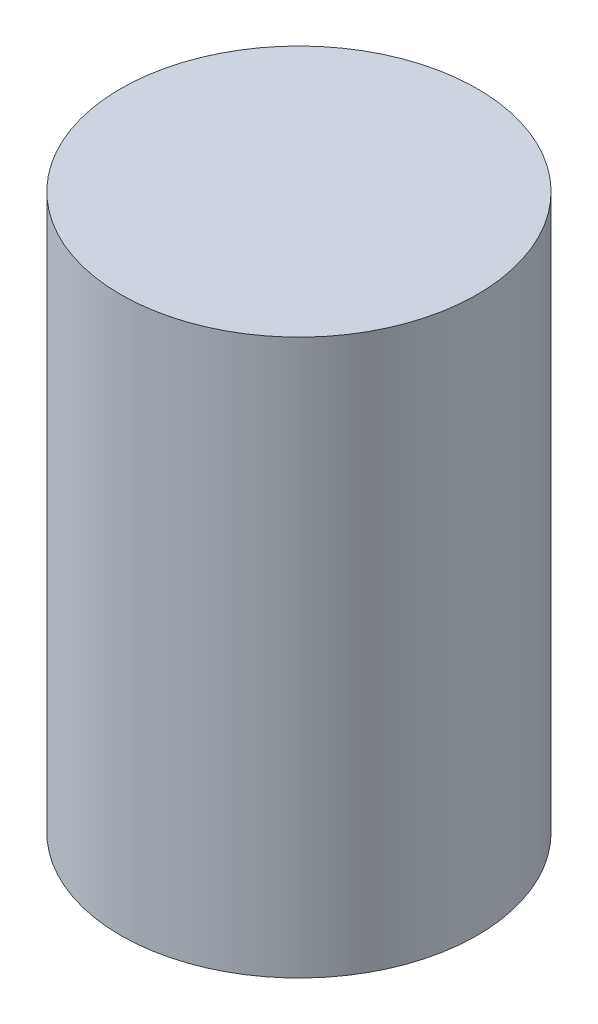
ISO-10303-21;
HEADER;
FILE_DESCRIPTION(('STEP AP214'),'2;1');
FILE_NAME('part.step','',(''),(''),'','','');
FILE_SCHEMA(('AUTOMOTIVE_DESIGN { 1 0 10303 214 1 1 1 1 }'));
ENDSEC;
DATA;
#1=APPLICATION_CONTEXT('core data for automotive mechanical design processes');
#2=APPLICATION_PROTOCOL_DEFINITION('international standard','automotive_design',2000,#1);
#3=PRODUCT_CONTEXT('',#1,'mechanical');
#4=PRODUCT('Part','Part','',(#3));
#5=PRODUCT_RELATED_PRODUCT_CATEGORY('part','',(#4));
#6=PRODUCT_DEFINITION_FORMATION('','',#4);
#7=PRODUCT_DEFINITION_CONTEXT('part definition',#1,'design');
#8=PRODUCT_DEFINITION('design','',#6,#7);
#9=PRODUCT_DEFINITION_SHAPE('','',#8);
#10=(LENGTH_UNIT() NAMED_UNIT(*) SI_UNIT(.MILLI.,.METRE.));
#11=(NAMED_UNIT(*) PLANE_ANGLE_UNIT() SI_UNIT($,.RADIAN.));
#12=(NAMED_UNIT(*) SI_UNIT($,.STERADIAN.) SOLID_ANGLE_UNIT());
#13=UNCERTAINTY_MEASURE_WITH_UNIT(LENGTH_MEASURE(1.E-05),#10,'distance_accuracy_value','');
#14=(GEOMETRIC_REPRESENTATION_CONTEXT(3) GLOBAL_UNCERTAINTY_ASSIGNED_CONTEXT((#13)) GLOBAL_UNIT_ASSIGNED_CONTEXT((#10,
#11,#12)) REPRESENTATION_CONTEXT('',''));
#15=CARTESIAN_POINT('',(0.,0.,0.));
#16=DIRECTION('',(0.,0.,1.));
#17=DIRECTION('',(1.,0.,0.));
#18=AXIS2_PLACEMENT_3D('',#15,#16,#17);
#19=CARTESIAN_POINT('',(0.,20.,0.));
#20=DIRECTION('',(0.,-1.,0.));
#21=DIRECTION('',(0.,0.,-1.));
#22=AXIS2_PLACEMENT_3D('',#19,#20,#21);
#23=CYLINDRICAL_SURFACE('',#22,6.425);
#24=CARTESIAN_POINT('',(0.,20.,0.));
#25=DIRECTION('',(0.,1.,0.));
#26=DIRECTION('',(0.,0.,1.));
#27=AXIS2_PLACEMENT_3D('',#24,#25,#26);
#28=CIRCLE('',#27,6.425);
#29=CARTESIAN_POINT('',(0.,20.,6.425));
#30=VERTEX_POINT('',#29);
#31=EDGE_CURVE('E10',#30,#30,#28,.T.);
#32=ORIENTED_EDGE('',*,*,#31,.F.);
#33=EDGE_LOOP('',(#32));
#34=FACE_BOUND('',#33,.T.);
#35=CARTESIAN_POINT('',(0.,0.,0.));
#36=DIRECTION('',(0.,1.,0.));
#37=DIRECTION('',(0.,0.,1.));
#38=AXIS2_PLACEMENT_3D('',#35,#36,#37);
#39=CIRCLE('',#38,6.425);
#40=CARTESIAN_POINT('',(0.,0.,6.425));
#41=VERTEX_POINT('',#40);
#42=EDGE_CURVE('E35',#41,#41,#39,.T.);
#43=ORIENTED_EDGE('',*,*,#42,.T.);
#44=EDGE_LOOP('',(#43));
#45=FACE_BOUND('',#44,.T.);
#46=ADVANCED_FACE('F32',(#34,#45),#23,.T.);
#47=CARTESIAN_POINT('',(0.,20.,0.));
#48=DIRECTION('',(0.,1.,0.));
#49=DIRECTION('',(0.,0.,1.));
#50=AXIS2_PLACEMENT_3D('',#47,#48,#49);
#51=PLANE('',#50);
#52=ORIENTED_EDGE('',*,*,#31,.T.);
#53=EDGE_LOOP('',(#52));
#54=FACE_BOUND('',#53,.T.);
#55=ADVANCED_FACE('F47',(#54),#51,.T.);
#56=CARTESIAN_POINT('',(0.,0.,0.));
#57=DIRECTION('',(0.,1.,0.));
#58=DIRECTION('',(0.,0.,1.));
#59=AXIS2_PLACEMENT_3D('',#56,#57,#58);
#60=PLANE('',#59);
#61=ORIENTED_EDGE('',*,*,#42,.F.);
#62=EDGE_LOOP('',(#61));
#63=FACE_BOUND('',#62,.T.);
#64=ADVANCED_FACE('F45',(#63),#60,.F.);
#65=CLOSED_SHELL('',(#46,#55,#64));
#66=MANIFOLD_SOLID_BREP('B2',#65);
#67=ADVANCED_BREP_SHAPE_REPRESENTATION('',(#18,#66),#14);
#68=SHAPE_DEFINITION_REPRESENTATION(#9,#67);
ENDSEC;
END-ISO-10303-21;
